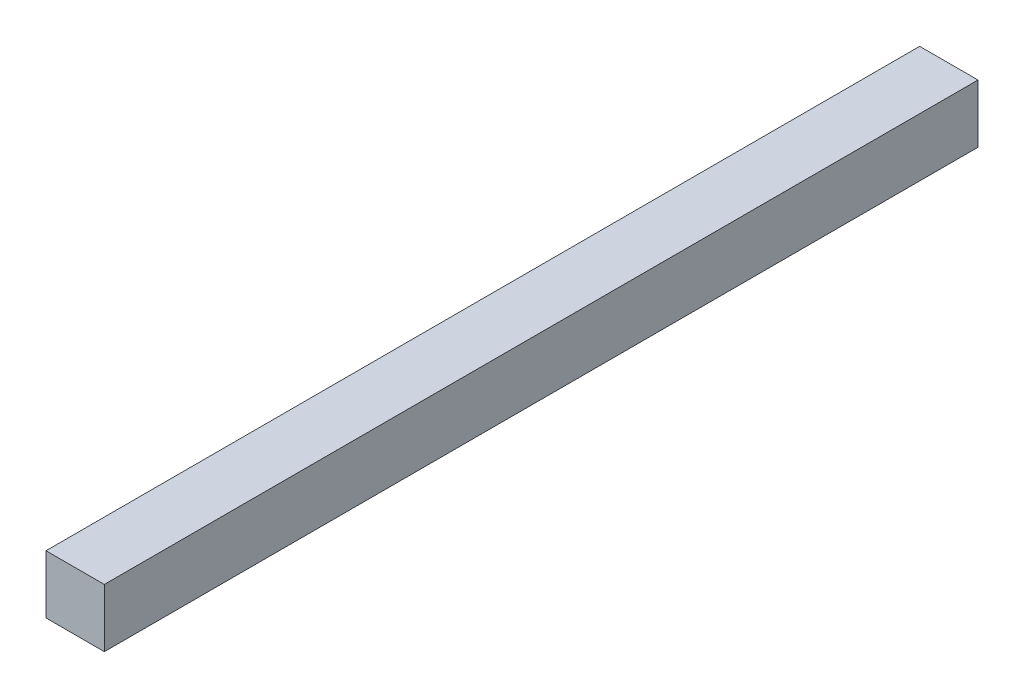
ISO-10303-21;
HEADER;
FILE_DESCRIPTION(('STEP AP214'),'2;1');
FILE_NAME('part.step','',(''),(''),'','','');
FILE_SCHEMA(('AUTOMOTIVE_DESIGN { 1 0 10303 214 1 1 1 1 }'));
ENDSEC;
DATA;
#1=APPLICATION_CONTEXT('core data for automotive mechanical design processes');
#2=APPLICATION_PROTOCOL_DEFINITION('international standard','automotive_design',2000,#1);
#3=PRODUCT_CONTEXT('',#1,'mechanical');
#4=PRODUCT('Part','Part','',(#3));
#5=PRODUCT_RELATED_PRODUCT_CATEGORY('part','',(#4));
#6=PRODUCT_DEFINITION_FORMATION('','',#4);
#7=PRODUCT_DEFINITION_CONTEXT('part definition',#1,'design');
#8=PRODUCT_DEFINITION('design','',#6,#7);
#9=PRODUCT_DEFINITION_SHAPE('','',#8);
#10=(LENGTH_UNIT() NAMED_UNIT(*) SI_UNIT(.MILLI.,.METRE.));
#11=(NAMED_UNIT(*) PLANE_ANGLE_UNIT() SI_UNIT($,.RADIAN.));
#12=(NAMED_UNIT(*) SI_UNIT($,.STERADIAN.) SOLID_ANGLE_UNIT());
#13=UNCERTAINTY_MEASURE_WITH_UNIT(LENGTH_MEASURE(1.E-05),#10,'distance_accuracy_value','');
#14=(GEOMETRIC_REPRESENTATION_CONTEXT(3) GLOBAL_UNCERTAINTY_ASSIGNED_CONTEXT((#13)) GLOBAL_UNIT_ASSIGNED_CONTEXT((#10,
#11,#12)) REPRESENTATION_CONTEXT('',''));
#15=CARTESIAN_POINT('',(0.,0.,0.));
#16=DIRECTION('',(0.,0.,1.));
#17=DIRECTION('',(1.,0.,0.));
#18=AXIS2_PLACEMENT_3D('',#15,#16,#17);
#19=CARTESIAN_POINT('',(-110.658276121753,30.,225.));
#20=DIRECTION('',(1.,0.,0.));
#21=DIRECTION('',(0.,0.,-1.));
#22=AXIS2_PLACEMENT_3D('',#19,#20,#21);
#23=PLANE('',#22);
#24=DIRECTION('',(0.,-1.,0.));
#25=VECTOR('',#24,1.);
#26=CARTESIAN_POINT('',(-110.658276121753,30.,-225.));
#27=LINE('',#26,#25);
#28=CARTESIAN_POINT('',(-110.658276121753,30.,-225.));
#29=VERTEX_POINT('',#28);
#30=CARTESIAN_POINT('',(-110.658276121753,0.,-225.));
#31=VERTEX_POINT('',#30);
#32=EDGE_CURVE('E107',#29,#31,#27,.T.);
#33=ORIENTED_EDGE('',*,*,#32,.T.);
#34=DIRECTION('',(0.,0.,-1.));
#35=VECTOR('',#34,1.);
#36=CARTESIAN_POINT('',(-110.658276121753,0.,225.));
#37=LINE('',#36,#35);
#38=CARTESIAN_POINT('',(-110.658276121753,0.,225.));
#39=VERTEX_POINT('',#38);
#40=EDGE_CURVE('E11',#39,#31,#37,.T.);
#41=ORIENTED_EDGE('',*,*,#40,.F.);
#42=DIRECTION('',(0.,-1.,0.));
#43=VECTOR('',#42,1.);
#44=CARTESIAN_POINT('',(-110.658276121753,30.,225.));
#45=LINE('',#44,#43);
#46=CARTESIAN_POINT('',(-110.658276121753,30.,225.));
#47=VERTEX_POINT('',#46);
#48=EDGE_CURVE('E91',#47,#39,#45,.T.);
#49=ORIENTED_EDGE('',*,*,#48,.F.);
#50=DIRECTION('',(0.,0.,-1.));
#51=VECTOR('',#50,1.);
#52=CARTESIAN_POINT('',(-110.658276121753,30.,225.));
#53=LINE('',#52,#51);
#54=EDGE_CURVE('E103',#47,#29,#53,.T.);
#55=ORIENTED_EDGE('',*,*,#54,.T.);
#56=EDGE_LOOP('',(#33,#41,#49,#55));
#57=FACE_BOUND('',#56,.T.);
#58=ADVANCED_FACE('F39',(#57),#23,.F.);
#59=CARTESIAN_POINT('',(-110.658276121753,0.,225.));
#60=DIRECTION('',(0.,1.,0.));
#61=DIRECTION('',(0.,0.,1.));
#62=AXIS2_PLACEMENT_3D('',#59,#60,#61);
#63=PLANE('',#62);
#64=DIRECTION('',(1.,0.,0.));
#65=VECTOR('',#64,1.);
#66=CARTESIAN_POINT('',(-110.658276121753,0.,-225.));
#67=LINE('',#66,#65);
#68=CARTESIAN_POINT('',(-80.6128609512064,0.,-225.));
#69=VERTEX_POINT('',#68);
#70=EDGE_CURVE('E96',#31,#69,#67,.T.);
#71=ORIENTED_EDGE('',*,*,#70,.T.);
#72=DIRECTION('',(0.,0.,-1.));
#73=VECTOR('',#72,1.);
#74=CARTESIAN_POINT('',(-80.6128609512064,0.,225.));
#75=LINE('',#74,#73);
#76=CARTESIAN_POINT('',(-80.6128609512064,0.,225.));
#77=VERTEX_POINT('',#76);
#78=EDGE_CURVE('E48',#77,#69,#75,.T.);
#79=ORIENTED_EDGE('',*,*,#78,.F.);
#80=DIRECTION('',(1.,0.,0.));
#81=VECTOR('',#80,1.);
#82=CARTESIAN_POINT('',(-110.658276121753,0.,225.));
#83=LINE('',#82,#81);
#84=EDGE_CURVE('E86',#39,#77,#83,.T.);
#85=ORIENTED_EDGE('',*,*,#84,.F.);
#86=ORIENTED_EDGE('',*,*,#40,.T.);
#87=EDGE_LOOP('',(#71,#79,#85,#86));
#88=FACE_BOUND('',#87,.T.);
#89=ADVANCED_FACE('F95',(#88),#63,.F.);
#90=CARTESIAN_POINT('',(-80.6128609512064,30.,225.));
#91=DIRECTION('',(-1.,0.,0.));
#92=DIRECTION('',(0.,0.,1.));
#93=AXIS2_PLACEMENT_3D('',#90,#91,#92);
#94=PLANE('',#93);
#95=DIRECTION('',(0.,1.,0.));
#96=VECTOR('',#95,1.);
#97=CARTESIAN_POINT('',(-80.6128609512064,30.,-225.));
#98=LINE('',#97,#96);
#99=CARTESIAN_POINT('',(-80.6128609512064,30.,-225.));
#100=VERTEX_POINT('',#99);
#101=EDGE_CURVE('E73',#69,#100,#98,.T.);
#102=ORIENTED_EDGE('',*,*,#101,.T.);
#103=DIRECTION('',(0.,0.,-1.));
#104=VECTOR('',#103,1.);
#105=CARTESIAN_POINT('',(-80.6128609512064,30.,225.));
#106=LINE('',#105,#104);
#107=CARTESIAN_POINT('',(-80.6128609512064,30.,225.));
#108=VERTEX_POINT('',#107);
#109=EDGE_CURVE('E98',#108,#100,#106,.T.);
#110=ORIENTED_EDGE('',*,*,#109,.F.);
#111=DIRECTION('',(0.,1.,0.));
#112=VECTOR('',#111,1.);
#113=CARTESIAN_POINT('',(-80.6128609512064,30.,225.));
#114=LINE('',#113,#112);
#115=EDGE_CURVE('E89',#77,#108,#114,.T.);
#116=ORIENTED_EDGE('',*,*,#115,.F.);
#117=ORIENTED_EDGE('',*,*,#78,.T.);
#118=EDGE_LOOP('',(#102,#110,#116,#117));
#119=FACE_BOUND('',#118,.T.);
#120=ADVANCED_FACE('F99',(#119),#94,.F.);
#121=CARTESIAN_POINT('',(-110.658276121753,30.,225.));
#122=DIRECTION('',(0.,-1.,0.));
#123=DIRECTION('',(0.,0.,-1.));
#124=AXIS2_PLACEMENT_3D('',#121,#122,#123);
#125=PLANE('',#124);
#126=DIRECTION('',(-1.,0.,0.));
#127=VECTOR('',#126,1.);
#128=CARTESIAN_POINT('',(-110.658276121753,30.,-225.));
#129=LINE('',#128,#127);
#130=EDGE_CURVE('E79',#100,#29,#129,.T.);
#131=ORIENTED_EDGE('',*,*,#130,.T.);
#132=ORIENTED_EDGE('',*,*,#54,.F.);
#133=DIRECTION('',(-1.,0.,0.));
#134=VECTOR('',#133,1.);
#135=CARTESIAN_POINT('',(-110.658276121753,30.,225.));
#136=LINE('',#135,#134);
#137=EDGE_CURVE('E56',#108,#47,#136,.T.);
#138=ORIENTED_EDGE('',*,*,#137,.F.);
#139=ORIENTED_EDGE('',*,*,#109,.T.);
#140=EDGE_LOOP('',(#131,#132,#138,#139));
#141=FACE_BOUND('',#140,.T.);
#142=ADVANCED_FACE('F120',(#141),#125,.F.);
#143=CARTESIAN_POINT('',(0.,0.,225.));
#144=DIRECTION('',(0.,0.,1.));
#145=DIRECTION('',(1.,0.,0.));
#146=AXIS2_PLACEMENT_3D('',#143,#144,#145);
#147=PLANE('',#146);
#148=ORIENTED_EDGE('',*,*,#48,.T.);
#149=ORIENTED_EDGE('',*,*,#84,.T.);
#150=ORIENTED_EDGE('',*,*,#115,.T.);
#151=ORIENTED_EDGE('',*,*,#137,.T.);
#152=EDGE_LOOP('',(#148,#149,#150,#151));
#153=FACE_BOUND('',#152,.T.);
#154=ADVANCED_FACE('F87',(#153),#147,.T.);
#155=CARTESIAN_POINT('',(0.,0.,-225.));
#156=DIRECTION('',(0.,0.,1.));
#157=DIRECTION('',(1.,0.,0.));
#158=AXIS2_PLACEMENT_3D('',#155,#156,#157);
#159=PLANE('',#158);
#160=ORIENTED_EDGE('',*,*,#32,.F.);
#161=ORIENTED_EDGE('',*,*,#130,.F.);
#162=ORIENTED_EDGE('',*,*,#101,.F.);
#163=ORIENTED_EDGE('',*,*,#70,.F.);
#164=EDGE_LOOP('',(#160,#161,#162,#163));
#165=FACE_BOUND('',#164,.T.);
#166=ADVANCED_FACE('F123',(#165),#159,.F.);
#167=CLOSED_SHELL('',(#58,#89,#120,#142,#154,#166));
#168=MANIFOLD_SOLID_BREP('B2',#167);
#169=ADVANCED_BREP_SHAPE_REPRESENTATION('',(#18,#168),#14);
#170=SHAPE_DEFINITION_REPRESENTATION(#9,#169);
ENDSEC;
END-ISO-10303-21;
